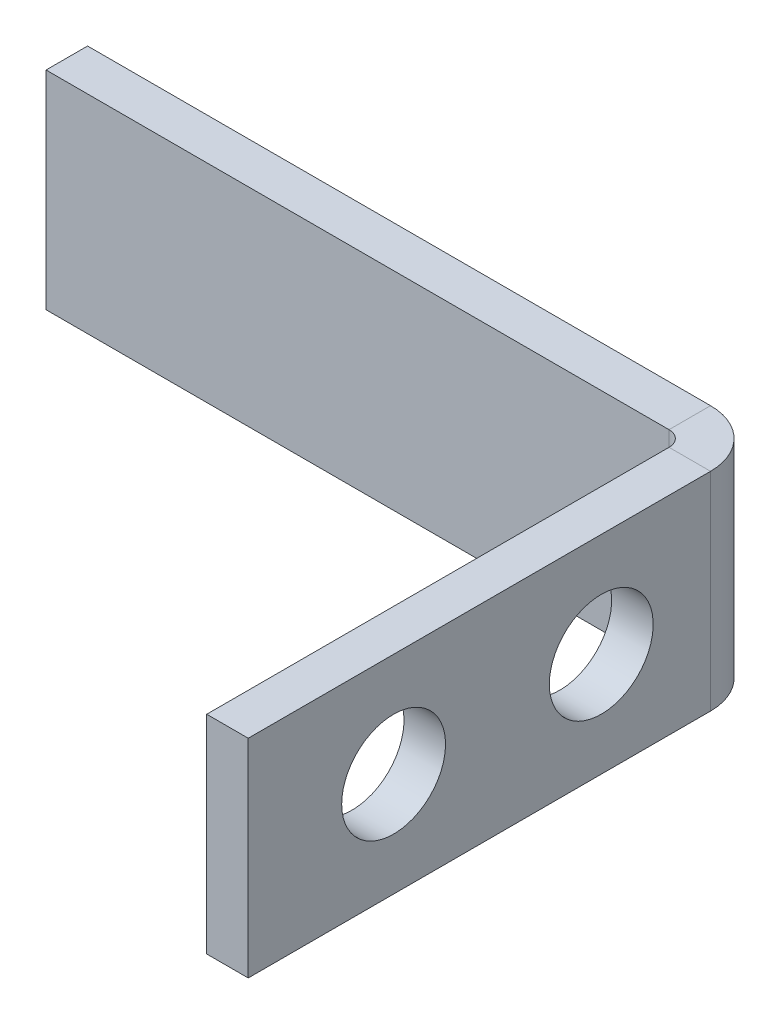
ISO-10303-21;
HEADER;
FILE_DESCRIPTION(('STEP AP214'),'2;1');
FILE_NAME('part.step','',(''),(''),'','','');
FILE_SCHEMA(('AUTOMOTIVE_DESIGN { 1 0 10303 214 1 1 1 1 }'));
ENDSEC;
DATA;
#1=APPLICATION_CONTEXT('core data for automotive mechanical design processes');
#2=APPLICATION_PROTOCOL_DEFINITION('international standard','automotive_design',2000,#1);
#3=PRODUCT_CONTEXT('',#1,'mechanical');
#4=PRODUCT('Part','Part','',(#3));
#5=PRODUCT_RELATED_PRODUCT_CATEGORY('part','',(#4));
#6=PRODUCT_DEFINITION_FORMATION('','',#4);
#7=PRODUCT_DEFINITION_CONTEXT('part definition',#1,'design');
#8=PRODUCT_DEFINITION('design','',#6,#7);
#9=PRODUCT_DEFINITION_SHAPE('','',#8);
#10=(LENGTH_UNIT() NAMED_UNIT(*) SI_UNIT(.MILLI.,.METRE.));
#11=(NAMED_UNIT(*) PLANE_ANGLE_UNIT() SI_UNIT($,.RADIAN.));
#12=(NAMED_UNIT(*) SI_UNIT($,.STERADIAN.) SOLID_ANGLE_UNIT());
#13=UNCERTAINTY_MEASURE_WITH_UNIT(LENGTH_MEASURE(1.E-05),#10,'distance_accuracy_value','');
#14=(GEOMETRIC_REPRESENTATION_CONTEXT(3) GLOBAL_UNCERTAINTY_ASSIGNED_CONTEXT((#13)) GLOBAL_UNIT_ASSIGNED_CONTEXT((#10,
#11,#12)) REPRESENTATION_CONTEXT('',''));
#15=CARTESIAN_POINT('',(0.,0.,0.));
#16=DIRECTION('',(0.,0.,1.));
#17=DIRECTION('',(1.,0.,0.));
#18=AXIS2_PLACEMENT_3D('',#15,#16,#17);
#19=CARTESIAN_POINT('',(-15.,-5.,-2.));
#20=DIRECTION('',(0.,-1.,0.));
#21=DIRECTION('',(0.,0.,-1.));
#22=AXIS2_PLACEMENT_3D('',#19,#20,#21);
#23=PLANE('',#22);
#24=DIRECTION('',(1.,0.,0.));
#25=VECTOR('',#24,1.);
#26=CARTESIAN_POINT('',(-15.,-5.,0.));
#27=LINE('',#26,#25);
#28=CARTESIAN_POINT('',(-15.,-5.,0.));
#29=VERTEX_POINT('',#28);
#30=CARTESIAN_POINT('',(15.,-5.,0.));
#31=VERTEX_POINT('',#30);
#32=EDGE_CURVE('E219',#29,#31,#27,.T.);
#33=ORIENTED_EDGE('',*,*,#32,.F.);
#34=DIRECTION('',(0.,0.,1.));
#35=VECTOR('',#34,1.);
#36=CARTESIAN_POINT('',(-15.,-5.,-2.));
#37=LINE('',#36,#35);
#38=CARTESIAN_POINT('',(-15.,-5.,-2.));
#39=VERTEX_POINT('',#38);
#40=EDGE_CURVE('E78',#39,#29,#37,.T.);
#41=ORIENTED_EDGE('',*,*,#40,.F.);
#42=DIRECTION('',(1.,0.,0.));
#43=VECTOR('',#42,1.);
#44=CARTESIAN_POINT('',(-15.,-5.,-2.));
#45=LINE('',#44,#43);
#46=CARTESIAN_POINT('',(15.,-5.,-2.));
#47=VERTEX_POINT('',#46);
#48=EDGE_CURVE('E226',#39,#47,#45,.T.);
#49=ORIENTED_EDGE('',*,*,#48,.T.);
#50=DIRECTION('',(0.,0.,1.));
#51=VECTOR('',#50,1.);
#52=CARTESIAN_POINT('',(15.,-5.,-2.));
#53=LINE('',#52,#51);
#54=EDGE_CURVE('E13',#47,#31,#53,.T.);
#55=ORIENTED_EDGE('',*,*,#54,.T.);
#56=EDGE_LOOP('',(#33,#41,#49,#55));
#57=FACE_BOUND('',#56,.T.);
#58=ADVANCED_FACE('F67',(#57),#23,.T.);
#59=CARTESIAN_POINT('',(-15.,5.,-2.));
#60=DIRECTION('',(-1.,0.,0.));
#61=DIRECTION('',(0.,0.,1.));
#62=AXIS2_PLACEMENT_3D('',#59,#60,#61);
#63=PLANE('',#62);
#64=DIRECTION('',(0.,-1.,0.));
#65=VECTOR('',#64,1.);
#66=CARTESIAN_POINT('',(-15.,5.,0.));
#67=LINE('',#66,#65);
#68=CARTESIAN_POINT('',(-15.,5.,0.));
#69=VERTEX_POINT('',#68);
#70=EDGE_CURVE('E236',#69,#29,#67,.T.);
#71=ORIENTED_EDGE('',*,*,#70,.F.);
#72=DIRECTION('',(0.,0.,1.));
#73=VECTOR('',#72,1.);
#74=CARTESIAN_POINT('',(-15.,5.,-2.));
#75=LINE('',#74,#73);
#76=CARTESIAN_POINT('',(-15.,5.,-2.));
#77=VERTEX_POINT('',#76);
#78=EDGE_CURVE('E111',#77,#69,#75,.T.);
#79=ORIENTED_EDGE('',*,*,#78,.F.);
#80=DIRECTION('',(0.,-1.,0.));
#81=VECTOR('',#80,1.);
#82=CARTESIAN_POINT('',(-15.,5.,-2.));
#83=LINE('',#82,#81);
#84=EDGE_CURVE('E223',#77,#39,#83,.T.);
#85=ORIENTED_EDGE('',*,*,#84,.T.);
#86=ORIENTED_EDGE('',*,*,#40,.T.);
#87=EDGE_LOOP('',(#71,#79,#85,#86));
#88=FACE_BOUND('',#87,.T.);
#89=ADVANCED_FACE('F302',(#88),#63,.T.);
#90=CARTESIAN_POINT('',(-15.,5.,-2.));
#91=DIRECTION('',(0.,1.,0.));
#92=DIRECTION('',(0.,0.,1.));
#93=AXIS2_PLACEMENT_3D('',#90,#91,#92);
#94=PLANE('',#93);
#95=DIRECTION('',(-1.,0.,0.));
#96=VECTOR('',#95,1.);
#97=CARTESIAN_POINT('',(-15.,5.,0.));
#98=LINE('',#97,#96);
#99=CARTESIAN_POINT('',(15.,5.,0.));
#100=VERTEX_POINT('',#99);
#101=EDGE_CURVE('E232',#100,#69,#98,.T.);
#102=ORIENTED_EDGE('',*,*,#101,.F.);
#103=DIRECTION('',(0.,0.,1.));
#104=VECTOR('',#103,1.);
#105=CARTESIAN_POINT('',(15.,5.,-2.));
#106=LINE('',#105,#104);
#107=CARTESIAN_POINT('',(15.,5.,-2.));
#108=VERTEX_POINT('',#107);
#109=EDGE_CURVE('E71',#108,#100,#106,.T.);
#110=ORIENTED_EDGE('',*,*,#109,.F.);
#111=DIRECTION('',(-1.,0.,0.));
#112=VECTOR('',#111,1.);
#113=CARTESIAN_POINT('',(-15.,5.,-2.));
#114=LINE('',#113,#112);
#115=EDGE_CURVE('E218',#108,#77,#114,.T.);
#116=ORIENTED_EDGE('',*,*,#115,.T.);
#117=ORIENTED_EDGE('',*,*,#78,.T.);
#118=EDGE_LOOP('',(#102,#110,#116,#117));
#119=FACE_BOUND('',#118,.T.);
#120=ADVANCED_FACE('F69',(#119),#94,.T.);
#121=CARTESIAN_POINT('',(0.,0.,-2.));
#122=DIRECTION('',(0.,0.,1.));
#123=DIRECTION('',(1.,0.,0.));
#124=AXIS2_PLACEMENT_3D('',#121,#122,#123);
#125=PLANE('',#124);
#126=DIRECTION('',(0.,1.,0.));
#127=VECTOR('',#126,1.);
#128=CARTESIAN_POINT('',(15.,5.,-2.));
#129=LINE('',#128,#127);
#130=EDGE_CURVE('E87',#47,#108,#129,.T.);
#131=ORIENTED_EDGE('',*,*,#130,.F.);
#132=ORIENTED_EDGE('',*,*,#48,.F.);
#133=ORIENTED_EDGE('',*,*,#84,.F.);
#134=ORIENTED_EDGE('',*,*,#115,.F.);
#135=EDGE_LOOP('',(#131,#132,#133,#134));
#136=FACE_BOUND('',#135,.T.);
#137=ADVANCED_FACE('F313',(#136),#125,.F.);
#138=CARTESIAN_POINT('',(0.,0.,0.));
#139=DIRECTION('',(0.,0.,1.));
#140=DIRECTION('',(1.,0.,0.));
#141=AXIS2_PLACEMENT_3D('',#138,#139,#140);
#142=PLANE('',#141);
#143=DIRECTION('',(0.,1.,0.));
#144=VECTOR('',#143,1.);
#145=CARTESIAN_POINT('',(15.,5.,0.));
#146=LINE('',#145,#144);
#147=EDGE_CURVE('E209',#31,#100,#146,.T.);
#148=ORIENTED_EDGE('',*,*,#147,.T.);
#149=ORIENTED_EDGE('',*,*,#101,.T.);
#150=ORIENTED_EDGE('',*,*,#70,.T.);
#151=ORIENTED_EDGE('',*,*,#32,.T.);
#152=EDGE_LOOP('',(#148,#149,#150,#151));
#153=FACE_BOUND('',#152,.T.);
#154=ADVANCED_FACE('F309',(#153),#142,.T.);
#155=CARTESIAN_POINT('',(15.,-5.,0.7366));
#156=DIRECTION('',(0.,-1.,0.));
#157=DIRECTION('',(0.,0.,-1.));
#158=AXIS2_PLACEMENT_3D('',#155,#156,#157);
#159=PLANE('',#158);
#160=DIRECTION('',(1.,0.,0.));
#161=VECTOR('',#160,1.);
#162=CARTESIAN_POINT('',(17.7366,-5.,0.73659999999999));
#163=LINE('',#162,#161);
#164=CARTESIAN_POINT('',(15.7366,-5.,0.736599999999997));
#165=VERTEX_POINT('',#164);
#166=CARTESIAN_POINT('',(17.7366,-5.,0.73659999999999));
#167=VERTEX_POINT('',#166);
#168=EDGE_CURVE('E203',#165,#167,#163,.T.);
#169=ORIENTED_EDGE('',*,*,#168,.F.);
#170=CARTESIAN_POINT('',(15.,-5.,0.7366));
#171=DIRECTION('',(0.,1.,0.));
#172=DIRECTION('',(0.,0.,1.));
#173=AXIS2_PLACEMENT_3D('',#170,#171,#172);
#174=CIRCLE('',#173,0.7366);
#175=EDGE_CURVE('E151',#31,#165,#174,.F.);
#176=ORIENTED_EDGE('',*,*,#175,.F.);
#177=ORIENTED_EDGE('',*,*,#54,.F.);
#178=CARTESIAN_POINT('',(15.,-5.,0.7366));
#179=DIRECTION('',(0.,1.,0.));
#180=DIRECTION('',(0.,0.,1.));
#181=AXIS2_PLACEMENT_3D('',#178,#179,#180);
#182=CIRCLE('',#181,2.7366);
#183=EDGE_CURVE('E150',#47,#167,#182,.F.);
#184=ORIENTED_EDGE('',*,*,#183,.T.);
#185=EDGE_LOOP('',(#169,#176,#177,#184));
#186=FACE_BOUND('',#185,.T.);
#187=ADVANCED_FACE('F312',(#186),#159,.T.);
#188=CARTESIAN_POINT('',(15.,5.,0.7366));
#189=DIRECTION('',(0.,-1.,0.));
#190=DIRECTION('',(0.,0.,-1.));
#191=AXIS2_PLACEMENT_3D('',#188,#189,#190);
#192=PLANE('',#191);
#193=CARTESIAN_POINT('',(15.,5.,0.7366));
#194=DIRECTION('',(0.,1.,0.));
#195=DIRECTION('',(0.,0.,1.));
#196=AXIS2_PLACEMENT_3D('',#193,#194,#195);
#197=CIRCLE('',#196,0.7366);
#198=CARTESIAN_POINT('',(15.7366,5.,0.736599999999997));
#199=VERTEX_POINT('',#198);
#200=EDGE_CURVE('E158',#199,#100,#197,.T.);
#201=ORIENTED_EDGE('',*,*,#200,.F.);
#202=DIRECTION('',(1.,0.,0.));
#203=VECTOR('',#202,1.);
#204=CARTESIAN_POINT('',(15.7366,5.,0.736599999999997));
#205=LINE('',#204,#203);
#206=CARTESIAN_POINT('',(17.7366,5.,0.73659999999999));
#207=VERTEX_POINT('',#206);
#208=EDGE_CURVE('E155',#199,#207,#205,.T.);
#209=ORIENTED_EDGE('',*,*,#208,.T.);
#210=CARTESIAN_POINT('',(15.,5.,0.7366));
#211=DIRECTION('',(0.,1.,0.));
#212=DIRECTION('',(0.,0.,1.));
#213=AXIS2_PLACEMENT_3D('',#210,#211,#212);
#214=CIRCLE('',#213,2.7366);
#215=EDGE_CURVE('E140',#207,#108,#214,.T.);
#216=ORIENTED_EDGE('',*,*,#215,.T.);
#217=ORIENTED_EDGE('',*,*,#109,.T.);
#218=EDGE_LOOP('',(#201,#209,#216,#217));
#219=FACE_BOUND('',#218,.T.);
#220=ADVANCED_FACE('F156',(#219),#192,.F.);
#221=CARTESIAN_POINT('',(15.,5.,0.7366));
#222=DIRECTION('',(0.,1.,0.));
#223=DIRECTION('',(1.,0.,0.));
#224=AXIS2_PLACEMENT_3D('',#221,#222,#223);
#225=CYLINDRICAL_SURFACE('',#224,2.7366);
#226=ORIENTED_EDGE('',*,*,#130,.T.);
#227=ORIENTED_EDGE('',*,*,#215,.F.);
#228=DIRECTION('',(0.,1.,0.));
#229=VECTOR('',#228,1.);
#230=CARTESIAN_POINT('',(17.7366,0.,0.73659999999999));
#231=LINE('',#230,#229);
#232=EDGE_CURVE('E145',#167,#207,#231,.T.);
#233=ORIENTED_EDGE('',*,*,#232,.F.);
#234=ORIENTED_EDGE('',*,*,#183,.F.);
#235=EDGE_LOOP('',(#226,#227,#233,#234));
#236=FACE_BOUND('',#235,.T.);
#237=ADVANCED_FACE('F142',(#236),#225,.T.);
#238=CARTESIAN_POINT('',(15.,5.,0.7366));
#239=DIRECTION('',(0.,1.,0.));
#240=DIRECTION('',(1.,0.,0.));
#241=AXIS2_PLACEMENT_3D('',#238,#239,#240);
#242=CYLINDRICAL_SURFACE('',#241,0.7366);
#243=ORIENTED_EDGE('',*,*,#147,.F.);
#244=ORIENTED_EDGE('',*,*,#175,.T.);
#245=DIRECTION('',(0.,-1.,0.));
#246=VECTOR('',#245,1.);
#247=CARTESIAN_POINT('',(15.7366,-5.,0.736599999999997));
#248=LINE('',#247,#246);
#249=EDGE_CURVE('E164',#165,#199,#248,.F.);
#250=ORIENTED_EDGE('',*,*,#249,.T.);
#251=ORIENTED_EDGE('',*,*,#200,.T.);
#252=EDGE_LOOP('',(#243,#244,#250,#251));
#253=FACE_BOUND('',#252,.T.);
#254=ADVANCED_FACE('F248',(#253),#242,.F.);
#255=CARTESIAN_POINT('',(17.7366,5.,0.));
#256=DIRECTION('',(0.,1.,0.));
#257=DIRECTION('',(0.,0.,1.));
#258=AXIS2_PLACEMENT_3D('',#255,#256,#257);
#259=PLANE('',#258);
#260=DIRECTION('',(0.,0.,-1.));
#261=VECTOR('',#260,1.);
#262=CARTESIAN_POINT('',(17.7366,5.,0.));
#263=LINE('',#262,#261);
#264=CARTESIAN_POINT('',(17.7366000000001,5.,23.));
#265=VERTEX_POINT('',#264);
#266=EDGE_CURVE('E171',#265,#207,#263,.T.);
#267=ORIENTED_EDGE('',*,*,#266,.T.);
#268=ORIENTED_EDGE('',*,*,#208,.F.);
#269=DIRECTION('',(0.,0.,1.));
#270=VECTOR('',#269,1.);
#271=CARTESIAN_POINT('',(15.7366,5.,0.));
#272=LINE('',#271,#270);
#273=CARTESIAN_POINT('',(15.7366000000001,5.,23.));
#274=VERTEX_POINT('',#273);
#275=EDGE_CURVE('E192',#274,#199,#272,.F.);
#276=ORIENTED_EDGE('',*,*,#275,.F.);
#277=DIRECTION('',(-1.,0.,0.));
#278=VECTOR('',#277,1.);
#279=CARTESIAN_POINT('',(17.7366000000001,5.,23.));
#280=LINE('',#279,#278);
#281=EDGE_CURVE('E177',#265,#274,#280,.T.);
#282=ORIENTED_EDGE('',*,*,#281,.F.);
#283=EDGE_LOOP('',(#267,#268,#276,#282));
#284=FACE_BOUND('',#283,.T.);
#285=ADVANCED_FACE('F176',(#284),#259,.T.);
#286=CARTESIAN_POINT('',(17.7366000000001,-5.,23.));
#287=DIRECTION('',(0.,-1.,0.));
#288=DIRECTION('',(0.,0.,-1.));
#289=AXIS2_PLACEMENT_3D('',#286,#287,#288);
#290=PLANE('',#289);
#291=DIRECTION('',(0.,0.,-1.));
#292=VECTOR('',#291,1.);
#293=CARTESIAN_POINT('',(15.7366,-5.,0.));
#294=LINE('',#293,#292);
#295=CARTESIAN_POINT('',(15.7366000000001,-5.,23.));
#296=VERTEX_POINT('',#295);
#297=EDGE_CURVE('E174',#165,#296,#294,.F.);
#298=ORIENTED_EDGE('',*,*,#297,.F.);
#299=ORIENTED_EDGE('',*,*,#168,.T.);
#300=DIRECTION('',(0.,0.,1.));
#301=VECTOR('',#300,1.);
#302=CARTESIAN_POINT('',(17.7366000000001,-5.,23.));
#303=LINE('',#302,#301);
#304=CARTESIAN_POINT('',(17.7366000000001,-5.,23.));
#305=VERTEX_POINT('',#304);
#306=EDGE_CURVE('E172',#167,#305,#303,.T.);
#307=ORIENTED_EDGE('',*,*,#306,.T.);
#308=DIRECTION('',(-1.,0.,0.));
#309=VECTOR('',#308,1.);
#310=CARTESIAN_POINT('',(17.7366000000001,-5.,23.));
#311=LINE('',#310,#309);
#312=EDGE_CURVE('E180',#305,#296,#311,.T.);
#313=ORIENTED_EDGE('',*,*,#312,.T.);
#314=EDGE_LOOP('',(#298,#299,#307,#313));
#315=FACE_BOUND('',#314,.T.);
#316=ADVANCED_FACE('F255',(#315),#290,.T.);
#317=CARTESIAN_POINT('',(17.7366,0.,0.));
#318=DIRECTION('',(1.,0.,0.));
#319=DIRECTION('',(0.,0.,-1.));
#320=AXIS2_PLACEMENT_3D('',#317,#318,#319);
#321=PLANE('',#320);
#322=CARTESIAN_POINT('',(17.7366000000001,0.,5.99999999999994));
#323=DIRECTION('',(-1.,0.,0.));
#324=DIRECTION('',(0.,0.,1.));
#325=AXIS2_PLACEMENT_3D('',#322,#323,#324);
#326=CIRCLE('',#325,2.5);
#327=CARTESIAN_POINT('',(17.7366000000001,0.,8.49999999999994));
#328=VERTEX_POINT('',#327);
#329=EDGE_CURVE('E207',#328,#328,#326,.T.);
#330=ORIENTED_EDGE('',*,*,#329,.T.);
#331=EDGE_LOOP('',(#330));
#332=FACE_BOUND('',#331,.T.);
#333=CARTESIAN_POINT('',(17.7366000000001,0.,15.9999999999999));
#334=DIRECTION('',(-1.,0.,0.));
#335=DIRECTION('',(0.,0.,1.));
#336=AXIS2_PLACEMENT_3D('',#333,#334,#335);
#337=CIRCLE('',#336,2.5);
#338=CARTESIAN_POINT('',(17.7366000000002,0.,18.4999999999999));
#339=VERTEX_POINT('',#338);
#340=EDGE_CURVE('E262',#339,#339,#337,.T.);
#341=ORIENTED_EDGE('',*,*,#340,.T.);
#342=EDGE_LOOP('',(#341));
#343=FACE_BOUND('',#342,.T.);
#344=ORIENTED_EDGE('',*,*,#306,.F.);
#345=ORIENTED_EDGE('',*,*,#232,.T.);
#346=ORIENTED_EDGE('',*,*,#266,.F.);
#347=DIRECTION('',(0.,1.,0.));
#348=VECTOR('',#347,1.);
#349=CARTESIAN_POINT('',(17.7366000000001,5.,23.));
#350=LINE('',#349,#348);
#351=EDGE_CURVE('E181',#305,#265,#350,.T.);
#352=ORIENTED_EDGE('',*,*,#351,.F.);
#353=EDGE_LOOP('',(#344,#345,#346,#352));
#354=FACE_BOUND('',#353,.T.);
#355=ADVANCED_FACE('F169',(#332,#343,#354),#321,.T.);
#356=CARTESIAN_POINT('',(15.7366,0.,0.));
#357=DIRECTION('',(1.,0.,0.));
#358=DIRECTION('',(0.,0.,-1.));
#359=AXIS2_PLACEMENT_3D('',#356,#357,#358);
#360=PLANE('',#359);
#361=CARTESIAN_POINT('',(15.7366,0.,5.99999999999995));
#362=DIRECTION('',(-1.,0.,0.));
#363=DIRECTION('',(0.,0.,1.));
#364=AXIS2_PLACEMENT_3D('',#361,#362,#363);
#365=CIRCLE('',#364,2.5);
#366=CARTESIAN_POINT('',(15.7366,0.,8.49999999999994));
#367=VERTEX_POINT('',#366);
#368=EDGE_CURVE('E270',#367,#367,#365,.T.);
#369=ORIENTED_EDGE('',*,*,#368,.F.);
#370=EDGE_LOOP('',(#369));
#371=FACE_BOUND('',#370,.T.);
#372=CARTESIAN_POINT('',(15.7366000000001,0.,15.9999999999999));
#373=DIRECTION('',(-1.,0.,0.));
#374=DIRECTION('',(0.,0.,1.));
#375=AXIS2_PLACEMENT_3D('',#372,#373,#374);
#376=CIRCLE('',#375,2.5);
#377=CARTESIAN_POINT('',(15.7366000000001,0.,18.4999999999999));
#378=VERTEX_POINT('',#377);
#379=EDGE_CURVE('E266',#378,#378,#376,.T.);
#380=ORIENTED_EDGE('',*,*,#379,.F.);
#381=EDGE_LOOP('',(#380));
#382=FACE_BOUND('',#381,.T.);
#383=ORIENTED_EDGE('',*,*,#249,.F.);
#384=ORIENTED_EDGE('',*,*,#297,.T.);
#385=DIRECTION('',(0.,-1.,0.));
#386=VECTOR('',#385,1.);
#387=CARTESIAN_POINT('',(15.7366000000001,0.,23.));
#388=LINE('',#387,#386);
#389=EDGE_CURVE('E195',#296,#274,#388,.F.);
#390=ORIENTED_EDGE('',*,*,#389,.T.);
#391=ORIENTED_EDGE('',*,*,#275,.T.);
#392=EDGE_LOOP('',(#383,#384,#390,#391));
#393=FACE_BOUND('',#392,.T.);
#394=ADVANCED_FACE('F253',(#371,#382,#393),#360,.F.);
#395=CARTESIAN_POINT('',(17.7366000000001,5.,23.));
#396=DIRECTION('',(0.,0.,1.));
#397=DIRECTION('',(1.,0.,0.));
#398=AXIS2_PLACEMENT_3D('',#395,#396,#397);
#399=PLANE('',#398);
#400=ORIENTED_EDGE('',*,*,#389,.F.);
#401=ORIENTED_EDGE('',*,*,#312,.F.);
#402=ORIENTED_EDGE('',*,*,#351,.T.);
#403=ORIENTED_EDGE('',*,*,#281,.T.);
#404=EDGE_LOOP('',(#400,#401,#402,#403));
#405=FACE_BOUND('',#404,.T.);
#406=ADVANCED_FACE('F259',(#405),#399,.T.);
#407=CARTESIAN_POINT('',(17.7366000000001,0.,15.9999999999999));
#408=DIRECTION('',(-1.,0.,0.));
#409=DIRECTION('',(0.,0.,1.));
#410=AXIS2_PLACEMENT_3D('',#407,#408,#409);
#411=CYLINDRICAL_SURFACE('',#410,2.5);
#412=ORIENTED_EDGE('',*,*,#340,.F.);
#413=EDGE_LOOP('',(#412));
#414=FACE_BOUND('',#413,.T.);
#415=ORIENTED_EDGE('',*,*,#379,.T.);
#416=EDGE_LOOP('',(#415));
#417=FACE_BOUND('',#416,.T.);
#418=ADVANCED_FACE('F283',(#414,#417),#411,.F.);
#419=CARTESIAN_POINT('',(17.7366000000001,0.,5.99999999999994));
#420=DIRECTION('',(-1.,0.,0.));
#421=DIRECTION('',(0.,0.,1.));
#422=AXIS2_PLACEMENT_3D('',#419,#420,#421);
#423=CYLINDRICAL_SURFACE('',#422,2.5);
#424=ORIENTED_EDGE('',*,*,#329,.F.);
#425=EDGE_LOOP('',(#424));
#426=FACE_BOUND('',#425,.T.);
#427=ORIENTED_EDGE('',*,*,#368,.T.);
#428=EDGE_LOOP('',(#427));
#429=FACE_BOUND('',#428,.T.);
#430=ADVANCED_FACE('F280',(#426,#429),#423,.F.);
#431=CLOSED_SHELL('',(#58,#89,#120,#137,#154,#187,#220,#237,#254,#285,#316,#355,#394,#406,#418,#430));
#432=MANIFOLD_SOLID_BREP('B2',#431);
#433=ADVANCED_BREP_SHAPE_REPRESENTATION('',(#18,#432),#14);
#434=SHAPE_DEFINITION_REPRESENTATION(#9,#433);
ENDSEC;
END-ISO-10303-21;
